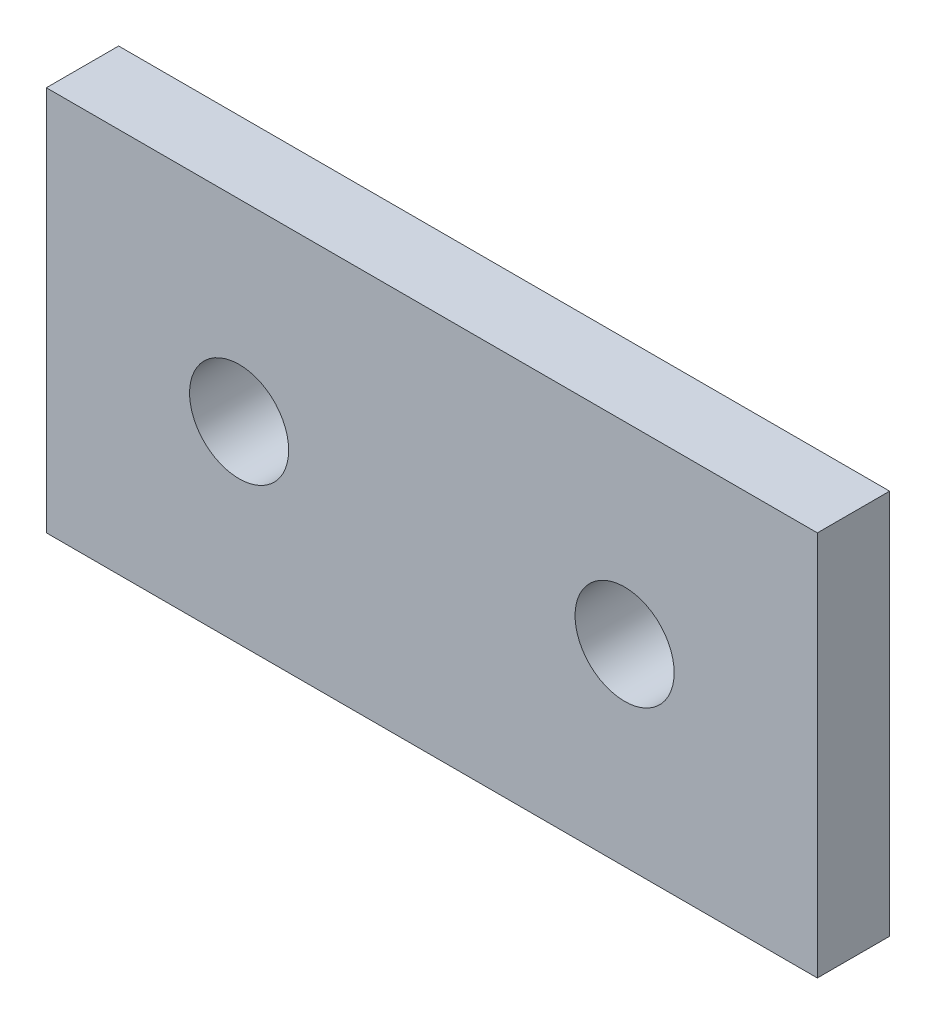
ISO-10303-21;
HEADER;
FILE_DESCRIPTION(('STEP AP214'),'2;1');
FILE_NAME('part.step','',(''),(''),'','','');
FILE_SCHEMA(('AUTOMOTIVE_DESIGN { 1 0 10303 214 1 1 1 1 }'));
ENDSEC;
DATA;
#1=APPLICATION_CONTEXT('core data for automotive mechanical design processes');
#2=APPLICATION_PROTOCOL_DEFINITION('international standard','automotive_design',2000,#1);
#3=PRODUCT_CONTEXT('',#1,'mechanical');
#4=PRODUCT('Part','Part','',(#3));
#5=PRODUCT_RELATED_PRODUCT_CATEGORY('part','',(#4));
#6=PRODUCT_DEFINITION_FORMATION('','',#4);
#7=PRODUCT_DEFINITION_CONTEXT('part definition',#1,'design');
#8=PRODUCT_DEFINITION('design','',#6,#7);
#9=PRODUCT_DEFINITION_SHAPE('','',#8);
#10=(LENGTH_UNIT() NAMED_UNIT(*) SI_UNIT(.MILLI.,.METRE.));
#11=(NAMED_UNIT(*) PLANE_ANGLE_UNIT() SI_UNIT($,.RADIAN.));
#12=(NAMED_UNIT(*) SI_UNIT($,.STERADIAN.) SOLID_ANGLE_UNIT());
#13=UNCERTAINTY_MEASURE_WITH_UNIT(LENGTH_MEASURE(1.E-05),#10,'distance_accuracy_value','');
#14=(GEOMETRIC_REPRESENTATION_CONTEXT(3) GLOBAL_UNCERTAINTY_ASSIGNED_CONTEXT((#13)) GLOBAL_UNIT_ASSIGNED_CONTEXT((#10,
#11,#12)) REPRESENTATION_CONTEXT('',''));
#15=CARTESIAN_POINT('',(0.,0.,0.));
#16=DIRECTION('',(0.,0.,1.));
#17=DIRECTION('',(1.,0.,0.));
#18=AXIS2_PLACEMENT_3D('',#15,#16,#17);
#19=CARTESIAN_POINT('',(0.,0.,2.38125));
#20=DIRECTION('',(0.,0.,-1.));
#21=DIRECTION('',(-1.,0.,0.));
#22=AXIS2_PLACEMENT_3D('',#19,#20,#21);
#23=PLANE('',#22);
#24=DIRECTION('',(1.,0.,0.));
#25=VECTOR('',#24,1.);
#26=CARTESIAN_POINT('',(50.8,0.,2.38125));
#27=LINE('',#26,#25);
#28=CARTESIAN_POINT('',(0.,0.,2.38125));
#29=VERTEX_POINT('',#28);
#30=CARTESIAN_POINT('',(50.8,0.,2.38125));
#31=VERTEX_POINT('',#30);
#32=EDGE_CURVE('E92',#29,#31,#27,.T.);
#33=ORIENTED_EDGE('',*,*,#32,.T.);
#34=DIRECTION('',(0.,1.,0.));
#35=VECTOR('',#34,1.);
#36=CARTESIAN_POINT('',(50.8,25.4,2.38125));
#37=LINE('',#36,#35);
#38=CARTESIAN_POINT('',(50.8,25.4,2.38125));
#39=VERTEX_POINT('',#38);
#40=EDGE_CURVE('E87',#31,#39,#37,.T.);
#41=ORIENTED_EDGE('',*,*,#40,.T.);
#42=DIRECTION('',(-1.,0.,0.));
#43=VECTOR('',#42,1.);
#44=CARTESIAN_POINT('',(50.8,25.4,2.38125));
#45=LINE('',#44,#43);
#46=CARTESIAN_POINT('',(0.,25.4,2.38125));
#47=VERTEX_POINT('',#46);
#48=EDGE_CURVE('E90',#39,#47,#45,.T.);
#49=ORIENTED_EDGE('',*,*,#48,.T.);
#50=DIRECTION('',(0.,-1.,0.));
#51=VECTOR('',#50,1.);
#52=CARTESIAN_POINT('',(0.,0.,2.38125));
#53=LINE('',#52,#51);
#54=EDGE_CURVE('E57',#47,#29,#53,.T.);
#55=ORIENTED_EDGE('',*,*,#54,.T.);
#56=EDGE_LOOP('',(#33,#41,#49,#55));
#57=FACE_BOUND('',#56,.T.);
#58=CARTESIAN_POINT('',(12.7,12.7,2.38125));
#59=DIRECTION('',(0.,0.,1.));
#60=DIRECTION('',(1.,0.,0.));
#61=AXIS2_PLACEMENT_3D('',#58,#59,#60);
#62=CIRCLE('',#61,3.2639);
#63=CARTESIAN_POINT('',(15.9639,12.7,2.38125));
#64=VERTEX_POINT('',#63);
#65=EDGE_CURVE('E112',#64,#64,#62,.T.);
#66=ORIENTED_EDGE('',*,*,#65,.F.);
#67=EDGE_LOOP('',(#66));
#68=FACE_BOUND('',#67,.T.);
#69=CARTESIAN_POINT('',(38.1,12.7,2.38125));
#70=DIRECTION('',(0.,0.,1.));
#71=DIRECTION('',(1.,0.,0.));
#72=AXIS2_PLACEMENT_3D('',#69,#70,#71);
#73=CIRCLE('',#72,3.2639);
#74=CARTESIAN_POINT('',(41.3639,12.7,2.38125));
#75=VERTEX_POINT('',#74);
#76=EDGE_CURVE('E134',#75,#75,#73,.T.);
#77=ORIENTED_EDGE('',*,*,#76,.F.);
#78=EDGE_LOOP('',(#77));
#79=FACE_BOUND('',#78,.T.);
#80=ADVANCED_FACE('F39',(#57,#68,#79),#23,.F.);
#81=CARTESIAN_POINT('',(0.,0.,-2.38125));
#82=DIRECTION('',(0.,0.,-1.));
#83=DIRECTION('',(-1.,0.,0.));
#84=AXIS2_PLACEMENT_3D('',#81,#82,#83);
#85=PLANE('',#84);
#86=CARTESIAN_POINT('',(12.7,12.7,-2.38125));
#87=DIRECTION('',(0.,0.,1.));
#88=DIRECTION('',(1.,0.,0.));
#89=AXIS2_PLACEMENT_3D('',#86,#87,#88);
#90=CIRCLE('',#89,3.2639);
#91=CARTESIAN_POINT('',(15.9639,12.7,-2.38125));
#92=VERTEX_POINT('',#91);
#93=EDGE_CURVE('E130',#92,#92,#90,.T.);
#94=ORIENTED_EDGE('',*,*,#93,.T.);
#95=EDGE_LOOP('',(#94));
#96=FACE_BOUND('',#95,.T.);
#97=DIRECTION('',(1.,0.,0.));
#98=VECTOR('',#97,1.);
#99=CARTESIAN_POINT('',(50.8,0.,-2.38125));
#100=LINE('',#99,#98);
#101=CARTESIAN_POINT('',(0.,0.,-2.38125));
#102=VERTEX_POINT('',#101);
#103=CARTESIAN_POINT('',(50.8,0.,-2.38125));
#104=VERTEX_POINT('',#103);
#105=EDGE_CURVE('E108',#102,#104,#100,.T.);
#106=ORIENTED_EDGE('',*,*,#105,.F.);
#107=DIRECTION('',(0.,-1.,0.));
#108=VECTOR('',#107,1.);
#109=CARTESIAN_POINT('',(0.,0.,-2.38125));
#110=LINE('',#109,#108);
#111=CARTESIAN_POINT('',(0.,25.4,-2.38125));
#112=VERTEX_POINT('',#111);
#113=EDGE_CURVE('E80',#112,#102,#110,.T.);
#114=ORIENTED_EDGE('',*,*,#113,.F.);
#115=DIRECTION('',(-1.,0.,0.));
#116=VECTOR('',#115,1.);
#117=CARTESIAN_POINT('',(50.8,25.4,-2.38125));
#118=LINE('',#117,#116);
#119=CARTESIAN_POINT('',(50.8,25.4,-2.38125));
#120=VERTEX_POINT('',#119);
#121=EDGE_CURVE('E74',#120,#112,#118,.T.);
#122=ORIENTED_EDGE('',*,*,#121,.F.);
#123=DIRECTION('',(0.,1.,0.));
#124=VECTOR('',#123,1.);
#125=CARTESIAN_POINT('',(50.8,25.4,-2.38125));
#126=LINE('',#125,#124);
#127=EDGE_CURVE('E97',#104,#120,#126,.T.);
#128=ORIENTED_EDGE('',*,*,#127,.F.);
#129=EDGE_LOOP('',(#106,#114,#122,#128));
#130=FACE_BOUND('',#129,.T.);
#131=CARTESIAN_POINT('',(38.1,12.7,-2.38125));
#132=DIRECTION('',(0.,0.,1.));
#133=DIRECTION('',(1.,0.,0.));
#134=AXIS2_PLACEMENT_3D('',#131,#132,#133);
#135=CIRCLE('',#134,3.2639);
#136=CARTESIAN_POINT('',(41.3639,12.7,-2.38125));
#137=VERTEX_POINT('',#136);
#138=EDGE_CURVE('E138',#137,#137,#135,.T.);
#139=ORIENTED_EDGE('',*,*,#138,.T.);
#140=EDGE_LOOP('',(#139));
#141=FACE_BOUND('',#140,.T.);
#142=ADVANCED_FACE('F125',(#96,#130,#141),#85,.T.);
#143=CARTESIAN_POINT('',(50.8,0.,2.38125));
#144=DIRECTION('',(0.,1.,0.));
#145=DIRECTION('',(-1.,0.,0.));
#146=AXIS2_PLACEMENT_3D('',#143,#144,#145);
#147=PLANE('',#146);
#148=ORIENTED_EDGE('',*,*,#105,.T.);
#149=DIRECTION('',(0.,0.,-1.));
#150=VECTOR('',#149,1.);
#151=CARTESIAN_POINT('',(50.8,0.,2.38125));
#152=LINE('',#151,#150);
#153=EDGE_CURVE('E11',#31,#104,#152,.T.);
#154=ORIENTED_EDGE('',*,*,#153,.F.);
#155=ORIENTED_EDGE('',*,*,#32,.F.);
#156=DIRECTION('',(0.,0.,-1.));
#157=VECTOR('',#156,1.);
#158=CARTESIAN_POINT('',(0.,0.,2.38125));
#159=LINE('',#158,#157);
#160=EDGE_CURVE('E104',#29,#102,#159,.T.);
#161=ORIENTED_EDGE('',*,*,#160,.T.);
#162=EDGE_LOOP('',(#148,#154,#155,#161));
#163=FACE_BOUND('',#162,.T.);
#164=ADVANCED_FACE('F41',(#163),#147,.F.);
#165=CARTESIAN_POINT('',(50.8,25.4,2.38125));
#166=DIRECTION('',(-1.,0.,0.));
#167=DIRECTION('',(0.,0.,1.));
#168=AXIS2_PLACEMENT_3D('',#165,#166,#167);
#169=PLANE('',#168);
#170=ORIENTED_EDGE('',*,*,#127,.T.);
#171=DIRECTION('',(0.,0.,-1.));
#172=VECTOR('',#171,1.);
#173=CARTESIAN_POINT('',(50.8,25.4,2.38125));
#174=LINE('',#173,#172);
#175=EDGE_CURVE('E49',#39,#120,#174,.T.);
#176=ORIENTED_EDGE('',*,*,#175,.F.);
#177=ORIENTED_EDGE('',*,*,#40,.F.);
#178=ORIENTED_EDGE('',*,*,#153,.T.);
#179=EDGE_LOOP('',(#170,#176,#177,#178));
#180=FACE_BOUND('',#179,.T.);
#181=ADVANCED_FACE('F96',(#180),#169,.F.);
#182=CARTESIAN_POINT('',(50.8,25.4,2.38125));
#183=DIRECTION('',(0.,-1.,0.));
#184=DIRECTION('',(1.,0.,0.));
#185=AXIS2_PLACEMENT_3D('',#182,#183,#184);
#186=PLANE('',#185);
#187=ORIENTED_EDGE('',*,*,#121,.T.);
#188=DIRECTION('',(0.,0.,-1.));
#189=VECTOR('',#188,1.);
#190=CARTESIAN_POINT('',(0.,25.4,2.38125));
#191=LINE('',#190,#189);
#192=EDGE_CURVE('E99',#47,#112,#191,.T.);
#193=ORIENTED_EDGE('',*,*,#192,.F.);
#194=ORIENTED_EDGE('',*,*,#48,.F.);
#195=ORIENTED_EDGE('',*,*,#175,.T.);
#196=EDGE_LOOP('',(#187,#193,#194,#195));
#197=FACE_BOUND('',#196,.T.);
#198=ADVANCED_FACE('F100',(#197),#186,.F.);
#199=CARTESIAN_POINT('',(0.,0.,2.38125));
#200=DIRECTION('',(1.,0.,0.));
#201=DIRECTION('',(0.,0.,-1.));
#202=AXIS2_PLACEMENT_3D('',#199,#200,#201);
#203=PLANE('',#202);
#204=ORIENTED_EDGE('',*,*,#113,.T.);
#205=ORIENTED_EDGE('',*,*,#160,.F.);
#206=ORIENTED_EDGE('',*,*,#54,.F.);
#207=ORIENTED_EDGE('',*,*,#192,.T.);
#208=EDGE_LOOP('',(#204,#205,#206,#207));
#209=FACE_BOUND('',#208,.T.);
#210=ADVANCED_FACE('F122',(#209),#203,.F.);
#211=CARTESIAN_POINT('',(12.7,12.7,2.38125));
#212=DIRECTION('',(0.,0.,-1.));
#213=DIRECTION('',(-1.,0.,0.));
#214=AXIS2_PLACEMENT_3D('',#211,#212,#213);
#215=CYLINDRICAL_SURFACE('',#214,3.2639);
#216=ORIENTED_EDGE('',*,*,#65,.T.);
#217=EDGE_LOOP('',(#216));
#218=FACE_BOUND('',#217,.T.);
#219=ORIENTED_EDGE('',*,*,#93,.F.);
#220=EDGE_LOOP('',(#219));
#221=FACE_BOUND('',#220,.T.);
#222=ADVANCED_FACE('F157',(#218,#221),#215,.F.);
#223=CARTESIAN_POINT('',(38.1,12.7,2.38125));
#224=DIRECTION('',(0.,0.,-1.));
#225=DIRECTION('',(-1.,0.,0.));
#226=AXIS2_PLACEMENT_3D('',#223,#224,#225);
#227=CYLINDRICAL_SURFACE('',#226,3.2639);
#228=ORIENTED_EDGE('',*,*,#76,.T.);
#229=EDGE_LOOP('',(#228));
#230=FACE_BOUND('',#229,.T.);
#231=ORIENTED_EDGE('',*,*,#138,.F.);
#232=EDGE_LOOP('',(#231));
#233=FACE_BOUND('',#232,.T.);
#234=ADVANCED_FACE('F146',(#230,#233),#227,.F.);
#235=CLOSED_SHELL('',(#80,#142,#164,#181,#198,#210,#222,#234));
#236=MANIFOLD_SOLID_BREP('B2',#235);
#237=ADVANCED_BREP_SHAPE_REPRESENTATION('',(#18,#236),#14);
#238=SHAPE_DEFINITION_REPRESENTATION(#9,#237);
ENDSEC;
END-ISO-10303-21;
